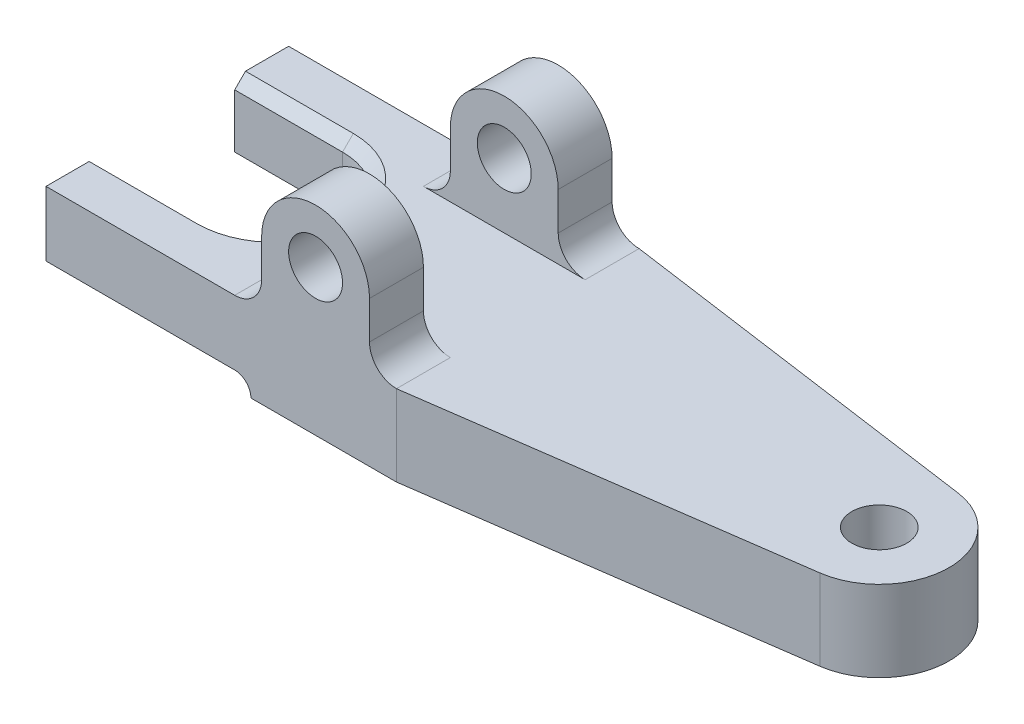
ISO-10303-21;
HEADER;
FILE_DESCRIPTION(('STEP AP214'),'2;1');
FILE_NAME('part.step','',(''),(''),'','','');
FILE_SCHEMA(('AUTOMOTIVE_DESIGN { 1 0 10303 214 1 1 1 1 }'));
ENDSEC;
DATA;
#1=APPLICATION_CONTEXT('core data for automotive mechanical design processes');
#2=APPLICATION_PROTOCOL_DEFINITION('international standard','automotive_design',2000,#1);
#3=PRODUCT_CONTEXT('',#1,'mechanical');
#4=PRODUCT('Part','Part','',(#3));
#5=PRODUCT_RELATED_PRODUCT_CATEGORY('part','',(#4));
#6=PRODUCT_DEFINITION_FORMATION('','',#4);
#7=PRODUCT_DEFINITION_CONTEXT('part definition',#1,'design');
#8=PRODUCT_DEFINITION('design','',#6,#7);
#9=PRODUCT_DEFINITION_SHAPE('','',#8);
#10=(LENGTH_UNIT() NAMED_UNIT(*) SI_UNIT(.MILLI.,.METRE.));
#11=(NAMED_UNIT(*) PLANE_ANGLE_UNIT() SI_UNIT($,.RADIAN.));
#12=(NAMED_UNIT(*) SI_UNIT($,.STERADIAN.) SOLID_ANGLE_UNIT());
#13=UNCERTAINTY_MEASURE_WITH_UNIT(LENGTH_MEASURE(1.E-05),#10,'distance_accuracy_value','');
#14=(GEOMETRIC_REPRESENTATION_CONTEXT(3) GLOBAL_UNCERTAINTY_ASSIGNED_CONTEXT((#13)) GLOBAL_UNIT_ASSIGNED_CONTEXT((#10,
#11,#12)) REPRESENTATION_CONTEXT('',''));
#15=CARTESIAN_POINT('',(0.,0.,0.));
#16=DIRECTION('',(0.,0.,1.));
#17=DIRECTION('',(1.,0.,0.));
#18=AXIS2_PLACEMENT_3D('',#15,#16,#17);
#19=CARTESIAN_POINT('',(112.050609730815,15.,0.));
#20=DIRECTION('',(0.,-1.,0.));
#21=DIRECTION('',(0.,0.,-1.));
#22=AXIS2_PLACEMENT_3D('',#19,#20,#21);
#23=PLANE('',#22);
#24=CARTESIAN_POINT('',(112.050609730815,15.,0.));
#25=DIRECTION('',(0.,1.,0.));
#26=DIRECTION('',(0.,0.,1.));
#27=AXIS2_PLACEMENT_3D('',#24,#25,#26);
#28=CIRCLE('',#27,5.09999999999999);
#29=CARTESIAN_POINT('',(112.050609730815,15.,5.09999999999999));
#30=VERTEX_POINT('',#29);
#31=EDGE_CURVE('E426',#30,#30,#28,.T.);
#32=ORIENTED_EDGE('',*,*,#31,.F.);
#33=EDGE_LOOP('',(#32));
#34=FACE_BOUND('',#33,.T.);
#35=CARTESIAN_POINT('',(0.,15.,0.));
#36=DIRECTION('',(0.,-1.,0.));
#37=DIRECTION('',(0.,0.,-1.));
#38=AXIS2_PLACEMENT_3D('',#35,#36,#37);
#39=CIRCLE('',#38,14.5);
#40=CARTESIAN_POINT('',(0.,15.,-14.5));
#41=VERTEX_POINT('',#40);
#42=CARTESIAN_POINT('',(0.,15.,14.5));
#43=VERTEX_POINT('',#42);
#44=EDGE_CURVE('E406',#41,#43,#39,.T.);
#45=ORIENTED_EDGE('',*,*,#44,.T.);
#46=DIRECTION('',(-1.,0.,0.));
#47=VECTOR('',#46,1.);
#48=CARTESIAN_POINT('',(112.050609730815,15.,14.5));
#49=LINE('',#48,#47);
#50=CARTESIAN_POINT('',(-20.,15.,14.5));
#51=VERTEX_POINT('',#50);
#52=EDGE_CURVE('E408',#43,#51,#49,.T.);
#53=ORIENTED_EDGE('',*,*,#52,.T.);
#54=DIRECTION('',(0.,0.,1.));
#55=VECTOR('',#54,1.);
#56=CARTESIAN_POINT('',(-20.,15.,22.5));
#57=LINE('',#56,#55);
#58=CARTESIAN_POINT('',(-20.,15.,22.5));
#59=VERTEX_POINT('',#58);
#60=EDGE_CURVE('E313',#51,#59,#57,.T.);
#61=ORIENTED_EDGE('',*,*,#60,.T.);
#62=DIRECTION('',(1.,0.,0.));
#63=VECTOR('',#62,1.);
#64=CARTESIAN_POINT('',(45.,15.,22.5));
#65=LINE('',#64,#63);
#66=CARTESIAN_POINT('',(15.,15.,22.5));
#67=VERTEX_POINT('',#66);
#68=EDGE_CURVE('E315',#59,#67,#65,.T.);
#69=ORIENTED_EDGE('',*,*,#68,.T.);
#70=DIRECTION('',(0.,0.,1.));
#71=VECTOR('',#70,1.);
#72=CARTESIAN_POINT('',(15.,15.,0.));
#73=LINE('',#72,#71);
#74=CARTESIAN_POINT('',(15.,15.,12.5));
#75=VERTEX_POINT('',#74);
#76=EDGE_CURVE('E366',#67,#75,#73,.F.);
#77=ORIENTED_EDGE('',*,*,#76,.T.);
#78=DIRECTION('',(1.,0.,0.));
#79=VECTOR('',#78,1.);
#80=CARTESIAN_POINT('',(40.,15.,12.5));
#81=LINE('',#80,#79);
#82=CARTESIAN_POINT('',(45.,15.,12.5));
#83=VERTEX_POINT('',#82);
#84=EDGE_CURVE('E262',#75,#83,#81,.T.);
#85=ORIENTED_EDGE('',*,*,#84,.T.);
#86=DIRECTION('',(0.,0.,1.));
#87=VECTOR('',#86,1.);
#88=CARTESIAN_POINT('',(45.,15.,0.));
#89=LINE('',#88,#87);
#90=CARTESIAN_POINT('',(45.,15.,22.5));
#91=VERTEX_POINT('',#90);
#92=EDGE_CURVE('E369',#83,#91,#89,.T.);
#93=ORIENTED_EDGE('',*,*,#92,.T.);
#94=DIRECTION('',(0.99026806874157,0.,-0.139173100960066));
#95=VECTOR('',#94,1.);
#96=CARTESIAN_POINT('',(113.85281653012,15.,12.8233676932463));
#97=LINE('',#96,#95);
#98=CARTESIAN_POINT('',(113.85281653012,15.,12.8233676932463));
#99=VERTEX_POINT('',#98);
#100=EDGE_CURVE('E319',#91,#99,#97,.T.);
#101=ORIENTED_EDGE('',*,*,#100,.T.);
#102=CARTESIAN_POINT('',(112.050609730815,15.,0.));
#103=DIRECTION('',(0.,1.,0.));
#104=DIRECTION('',(0.,0.,-1.));
#105=AXIS2_PLACEMENT_3D('',#102,#103,#104);
#106=CIRCLE('',#105,12.9493902691846);
#107=CARTESIAN_POINT('',(113.85281653012,15.,-12.8233676932463));
#108=VERTEX_POINT('',#107);
#109=EDGE_CURVE('E321',#99,#108,#106,.T.);
#110=ORIENTED_EDGE('',*,*,#109,.T.);
#111=DIRECTION('',(-0.99026806874157,0.,-0.139173100960066));
#112=VECTOR('',#111,1.);
#113=CARTESIAN_POINT('',(45.,15.,-22.5));
#114=LINE('',#113,#112);
#115=CARTESIAN_POINT('',(45.,15.,-22.5));
#116=VERTEX_POINT('',#115);
#117=EDGE_CURVE('E323',#108,#116,#114,.T.);
#118=ORIENTED_EDGE('',*,*,#117,.T.);
#119=DIRECTION('',(0.,0.,-1.));
#120=VECTOR('',#119,1.);
#121=CARTESIAN_POINT('',(45.,15.,-12.5));
#122=LINE('',#121,#120);
#123=CARTESIAN_POINT('',(45.,15.,-12.5));
#124=VERTEX_POINT('',#123);
#125=EDGE_CURVE('E392',#116,#124,#122,.F.);
#126=ORIENTED_EDGE('',*,*,#125,.T.);
#127=DIRECTION('',(1.,0.,0.));
#128=VECTOR('',#127,1.);
#129=CARTESIAN_POINT('',(40.,15.,-12.5));
#130=LINE('',#129,#128);
#131=CARTESIAN_POINT('',(15.,15.,-12.5));
#132=VERTEX_POINT('',#131);
#133=EDGE_CURVE('E242',#132,#124,#130,.T.);
#134=ORIENTED_EDGE('',*,*,#133,.F.);
#135=DIRECTION('',(0.,0.,-1.));
#136=VECTOR('',#135,1.);
#137=CARTESIAN_POINT('',(15.,15.,-22.5));
#138=LINE('',#137,#136);
#139=CARTESIAN_POINT('',(15.,15.,-22.5));
#140=VERTEX_POINT('',#139);
#141=EDGE_CURVE('E389',#132,#140,#138,.T.);
#142=ORIENTED_EDGE('',*,*,#141,.T.);
#143=DIRECTION('',(-1.,0.,0.));
#144=VECTOR('',#143,1.);
#145=CARTESIAN_POINT('',(-20.,15.,-22.5));
#146=LINE('',#145,#144);
#147=CARTESIAN_POINT('',(-20.,15.,-22.5));
#148=VERTEX_POINT('',#147);
#149=EDGE_CURVE('E326',#140,#148,#146,.T.);
#150=ORIENTED_EDGE('',*,*,#149,.T.);
#151=DIRECTION('',(0.,0.,1.));
#152=VECTOR('',#151,1.);
#153=CARTESIAN_POINT('',(-20.,15.,-12.5));
#154=LINE('',#153,#152);
#155=CARTESIAN_POINT('',(-20.,15.,-14.5));
#156=VERTEX_POINT('',#155);
#157=EDGE_CURVE('E328',#148,#156,#154,.T.);
#158=ORIENTED_EDGE('',*,*,#157,.T.);
#159=DIRECTION('',(1.,0.,0.));
#160=VECTOR('',#159,1.);
#161=CARTESIAN_POINT('',(112.050609730815,15.,-14.5000000000001));
#162=LINE('',#161,#160);
#163=EDGE_CURVE('E404',#156,#41,#162,.T.);
#164=ORIENTED_EDGE('',*,*,#163,.T.);
#165=EDGE_LOOP('',(#45,#53,#61,#69,#77,#85,#93,#101,#110,#118,#126,#134,#142,#150,#158,#164));
#166=FACE_BOUND('',#165,.T.);
#167=ADVANCED_FACE('F47',(#34,#166),#23,.F.);
#168=CARTESIAN_POINT('',(0.,15.,-12.5));
#169=DIRECTION('',(0.,0.,-1.));
#170=DIRECTION('',(-1.,0.,0.));
#171=AXIS2_PLACEMENT_3D('',#168,#169,#170);
#172=PLANE('',#171);
#173=DIRECTION('',(0.,-1.,0.));
#174=VECTOR('',#173,1.);
#175=CARTESIAN_POINT('',(0.,15.,-12.5));
#176=LINE('',#175,#174);
#177=CARTESIAN_POINT('',(0.,13.,-12.5));
#178=VERTEX_POINT('',#177);
#179=CARTESIAN_POINT('',(0.,3.,-12.5));
#180=VERTEX_POINT('',#179);
#181=EDGE_CURVE('E364',#178,#180,#176,.T.);
#182=ORIENTED_EDGE('',*,*,#181,.F.);
#183=DIRECTION('',(-1.,0.,0.));
#184=VECTOR('',#183,1.);
#185=CARTESIAN_POINT('',(0.,13.,-12.5));
#186=LINE('',#185,#184);
#187=CARTESIAN_POINT('',(-20.,13.,-12.5));
#188=VERTEX_POINT('',#187);
#189=EDGE_CURVE('E56',#178,#188,#186,.T.);
#190=ORIENTED_EDGE('',*,*,#189,.T.);
#191=DIRECTION('',(0.,-1.,0.));
#192=VECTOR('',#191,1.);
#193=CARTESIAN_POINT('',(-20.,15.,-12.5));
#194=LINE('',#193,#192);
#195=CARTESIAN_POINT('',(-20.,3.,-12.5));
#196=VERTEX_POINT('',#195);
#197=EDGE_CURVE('E331',#188,#196,#194,.T.);
#198=ORIENTED_EDGE('',*,*,#197,.T.);
#199=DIRECTION('',(1.,0.,0.));
#200=VECTOR('',#199,1.);
#201=CARTESIAN_POINT('',(0.,3.,-12.5));
#202=LINE('',#201,#200);
#203=EDGE_CURVE('E309',#196,#180,#202,.T.);
#204=ORIENTED_EDGE('',*,*,#203,.T.);
#205=EDGE_LOOP('',(#182,#190,#198,#204));
#206=FACE_BOUND('',#205,.T.);
#207=ADVANCED_FACE('F455',(#206),#172,.F.);
#208=CARTESIAN_POINT('',(0.,15.,0.));
#209=DIRECTION('',(0.,-1.,0.));
#210=DIRECTION('',(0.,0.,-1.));
#211=AXIS2_PLACEMENT_3D('',#208,#209,#210);
#212=CYLINDRICAL_SURFACE('',#211,12.5);
#213=DIRECTION('',(0.,-1.,0.));
#214=VECTOR('',#213,1.);
#215=CARTESIAN_POINT('',(0.,15.,12.5));
#216=LINE('',#215,#214);
#217=CARTESIAN_POINT('',(0.,13.,12.5));
#218=VERTEX_POINT('',#217);
#219=CARTESIAN_POINT('',(0.,3.,12.5));
#220=VERTEX_POINT('',#219);
#221=EDGE_CURVE('E362',#218,#220,#216,.T.);
#222=ORIENTED_EDGE('',*,*,#221,.F.);
#223=CARTESIAN_POINT('',(0.,13.,0.));
#224=DIRECTION('',(0.,-1.,0.));
#225=DIRECTION('',(0.,0.,-1.));
#226=AXIS2_PLACEMENT_3D('',#223,#224,#225);
#227=CIRCLE('',#226,12.5);
#228=EDGE_CURVE('E71',#218,#178,#227,.F.);
#229=ORIENTED_EDGE('',*,*,#228,.T.);
#230=ORIENTED_EDGE('',*,*,#181,.T.);
#231=CARTESIAN_POINT('',(0.,3.,0.));
#232=DIRECTION('',(0.,1.,0.));
#233=DIRECTION('',(-1.,0.,0.));
#234=AXIS2_PLACEMENT_3D('',#231,#232,#233);
#235=CIRCLE('',#234,12.5);
#236=EDGE_CURVE('E306',#180,#220,#235,.F.);
#237=ORIENTED_EDGE('',*,*,#236,.T.);
#238=EDGE_LOOP('',(#222,#229,#230,#237));
#239=FACE_BOUND('',#238,.T.);
#240=ADVANCED_FACE('F461',(#239),#212,.F.);
#241=CARTESIAN_POINT('',(-20.,15.,12.5));
#242=DIRECTION('',(0.,0.,1.));
#243=DIRECTION('',(1.,0.,0.));
#244=AXIS2_PLACEMENT_3D('',#241,#242,#243);
#245=PLANE('',#244);
#246=DIRECTION('',(0.,-1.,0.));
#247=VECTOR('',#246,1.);
#248=CARTESIAN_POINT('',(-20.,15.,12.5));
#249=LINE('',#248,#247);
#250=CARTESIAN_POINT('',(-20.,13.,12.5));
#251=VERTEX_POINT('',#250);
#252=CARTESIAN_POINT('',(-20.,3.,12.5));
#253=VERTEX_POINT('',#252);
#254=EDGE_CURVE('E360',#251,#253,#249,.T.);
#255=ORIENTED_EDGE('',*,*,#254,.F.);
#256=DIRECTION('',(1.,0.,0.));
#257=VECTOR('',#256,1.);
#258=CARTESIAN_POINT('',(-20.,13.,12.5));
#259=LINE('',#258,#257);
#260=EDGE_CURVE('E413',#251,#218,#259,.T.);
#261=ORIENTED_EDGE('',*,*,#260,.T.);
#262=ORIENTED_EDGE('',*,*,#221,.T.);
#263=DIRECTION('',(-1.,0.,0.));
#264=VECTOR('',#263,1.);
#265=CARTESIAN_POINT('',(-20.,3.,12.5));
#266=LINE('',#265,#264);
#267=EDGE_CURVE('E299',#220,#253,#266,.T.);
#268=ORIENTED_EDGE('',*,*,#267,.T.);
#269=EDGE_LOOP('',(#255,#261,#262,#268));
#270=FACE_BOUND('',#269,.T.);
#271=ADVANCED_FACE('F499',(#270),#245,.F.);
#272=CARTESIAN_POINT('',(-20.,15.,22.5));
#273=DIRECTION('',(1.,0.,0.));
#274=DIRECTION('',(0.,0.,-1.));
#275=AXIS2_PLACEMENT_3D('',#272,#273,#274);
#276=PLANE('',#275);
#277=ORIENTED_EDGE('',*,*,#60,.F.);
#278=DIRECTION('',(0.,0.70710678118655,0.707106781186545));
#279=VECTOR('',#278,1.);
#280=CARTESIAN_POINT('',(-20.,15.,14.5));
#281=LINE('',#280,#279);
#282=EDGE_CURVE('E411',#51,#251,#281,.F.);
#283=ORIENTED_EDGE('',*,*,#282,.T.);
#284=ORIENTED_EDGE('',*,*,#254,.T.);
#285=DIRECTION('',(0.,0.,1.));
#286=VECTOR('',#285,1.);
#287=CARTESIAN_POINT('',(-20.,3.,-22.5));
#288=LINE('',#287,#286);
#289=CARTESIAN_POINT('',(-20.,3.,22.5));
#290=VERTEX_POINT('',#289);
#291=EDGE_CURVE('E300',#253,#290,#288,.T.);
#292=ORIENTED_EDGE('',*,*,#291,.T.);
#293=DIRECTION('',(0.,-1.,0.));
#294=VECTOR('',#293,1.);
#295=CARTESIAN_POINT('',(-20.,15.,22.5));
#296=LINE('',#295,#294);
#297=EDGE_CURVE('E357',#59,#290,#296,.T.);
#298=ORIENTED_EDGE('',*,*,#297,.F.);
#299=EDGE_LOOP('',(#277,#283,#284,#292,#298));
#300=FACE_BOUND('',#299,.T.);
#301=ADVANCED_FACE('F495',(#300),#276,.F.);
#302=CARTESIAN_POINT('',(45.,15.,22.5));
#303=DIRECTION('',(0.,0.,-1.));
#304=DIRECTION('',(-1.,0.,0.));
#305=AXIS2_PLACEMENT_3D('',#302,#303,#304);
#306=PLANE('',#305);
#307=ORIENTED_EDGE('',*,*,#297,.T.);
#308=DIRECTION('',(-1.,0.,0.));
#309=VECTOR('',#308,1.);
#310=CARTESIAN_POINT('',(-20.,3.,22.5));
#311=LINE('',#310,#309);
#312=CARTESIAN_POINT('',(15.,3.,22.5));
#313=VERTEX_POINT('',#312);
#314=EDGE_CURVE('E289',#313,#290,#311,.T.);
#315=ORIENTED_EDGE('',*,*,#314,.F.);
#316=CARTESIAN_POINT('',(15.,0.,22.5));
#317=DIRECTION('',(0.,0.,1.));
#318=DIRECTION('',(-1.,0.,0.));
#319=AXIS2_PLACEMENT_3D('',#316,#317,#318);
#320=CIRCLE('',#319,3.);
#321=CARTESIAN_POINT('',(18.,0.,22.5));
#322=VERTEX_POINT('',#321);
#323=EDGE_CURVE('E282',#322,#313,#320,.T.);
#324=ORIENTED_EDGE('',*,*,#323,.F.);
#325=DIRECTION('',(1.,0.,0.));
#326=VECTOR('',#325,1.);
#327=CARTESIAN_POINT('',(45.,0.,22.5));
#328=LINE('',#327,#326);
#329=CARTESIAN_POINT('',(45.,0.,22.5));
#330=VERTEX_POINT('',#329);
#331=EDGE_CURVE('E312',#322,#330,#328,.T.);
#332=ORIENTED_EDGE('',*,*,#331,.T.);
#333=DIRECTION('',(0.,-1.,0.));
#334=VECTOR('',#333,1.);
#335=CARTESIAN_POINT('',(45.,15.,22.5));
#336=LINE('',#335,#334);
#337=EDGE_CURVE('E354',#91,#330,#336,.T.);
#338=ORIENTED_EDGE('',*,*,#337,.F.);
#339=CARTESIAN_POINT('',(45.,20.,22.5));
#340=DIRECTION('',(0.,0.,-1.));
#341=DIRECTION('',(-1.,0.,0.));
#342=AXIS2_PLACEMENT_3D('',#339,#340,#341);
#343=CIRCLE('',#342,5.);
#344=CARTESIAN_POINT('',(40.,20.,22.5));
#345=VERTEX_POINT('',#344);
#346=EDGE_CURVE('E377',#91,#345,#343,.T.);
#347=ORIENTED_EDGE('',*,*,#346,.T.);
#348=DIRECTION('',(0.,1.,0.));
#349=VECTOR('',#348,1.);
#350=CARTESIAN_POINT('',(40.,27.,22.5));
#351=LINE('',#350,#349);
#352=CARTESIAN_POINT('',(40.,27.,22.5));
#353=VERTEX_POINT('',#352);
#354=EDGE_CURVE('E259',#345,#353,#351,.T.);
#355=ORIENTED_EDGE('',*,*,#354,.T.);
#356=CARTESIAN_POINT('',(30.,27.,22.5));
#357=DIRECTION('',(0.,0.,1.));
#358=DIRECTION('',(-1.,0.,0.));
#359=AXIS2_PLACEMENT_3D('',#356,#357,#358);
#360=CIRCLE('',#359,10.);
#361=CARTESIAN_POINT('',(20.,27.,22.5));
#362=VERTEX_POINT('',#361);
#363=EDGE_CURVE('E275',#353,#362,#360,.T.);
#364=ORIENTED_EDGE('',*,*,#363,.T.);
#365=DIRECTION('',(0.,-1.,0.));
#366=VECTOR('',#365,1.);
#367=CARTESIAN_POINT('',(20.,15.,22.5));
#368=LINE('',#367,#366);
#369=CARTESIAN_POINT('',(20.,20.,22.5));
#370=VERTEX_POINT('',#369);
#371=EDGE_CURVE('E265',#362,#370,#368,.T.);
#372=ORIENTED_EDGE('',*,*,#371,.T.);
#373=CARTESIAN_POINT('',(15.,20.,22.5));
#374=DIRECTION('',(0.,0.,-1.));
#375=DIRECTION('',(-1.,0.,0.));
#376=AXIS2_PLACEMENT_3D('',#373,#374,#375);
#377=CIRCLE('',#376,5.);
#378=EDGE_CURVE('E382',#370,#67,#377,.T.);
#379=ORIENTED_EDGE('',*,*,#378,.T.);
#380=ORIENTED_EDGE('',*,*,#68,.F.);
#381=EDGE_LOOP('',(#307,#315,#324,#332,#338,#347,#355,#364,#372,#379,#380));
#382=FACE_BOUND('',#381,.T.);
#383=CARTESIAN_POINT('',(30.,27.,22.5));
#384=DIRECTION('',(0.,0.,1.));
#385=DIRECTION('',(1.,0.,0.));
#386=AXIS2_PLACEMENT_3D('',#383,#384,#385);
#387=CIRCLE('',#386,4.99999999999999);
#388=CARTESIAN_POINT('',(35.,27.,22.5));
#389=VERTEX_POINT('',#388);
#390=EDGE_CURVE('E254',#389,#389,#387,.T.);
#391=ORIENTED_EDGE('',*,*,#390,.F.);
#392=EDGE_LOOP('',(#391));
#393=FACE_BOUND('',#392,.T.);
#394=ADVANCED_FACE('F491',(#382,#393),#306,.F.);
#395=CARTESIAN_POINT('',(113.85281653012,15.,12.8233676932463));
#396=DIRECTION('',(-0.139173100960066,0.,-0.99026806874157));
#397=DIRECTION('',(-0.99026806874157,0.,0.139173100960066));
#398=AXIS2_PLACEMENT_3D('',#395,#396,#397);
#399=PLANE('',#398);
#400=DIRECTION('',(0.99026806874157,0.,-0.139173100960066));
#401=VECTOR('',#400,1.);
#402=CARTESIAN_POINT('',(113.85281653012,0.,12.8233676932463));
#403=LINE('',#402,#401);
#404=CARTESIAN_POINT('',(113.85281653012,0.,12.8233676932463));
#405=VERTEX_POINT('',#404);
#406=EDGE_CURVE('E333',#330,#405,#403,.T.);
#407=ORIENTED_EDGE('',*,*,#406,.T.);
#408=DIRECTION('',(0.,-1.,0.));
#409=VECTOR('',#408,1.);
#410=CARTESIAN_POINT('',(113.85281653012,15.,12.8233676932463));
#411=LINE('',#410,#409);
#412=EDGE_CURVE('E351',#99,#405,#411,.T.);
#413=ORIENTED_EDGE('',*,*,#412,.F.);
#414=ORIENTED_EDGE('',*,*,#100,.F.);
#415=ORIENTED_EDGE('',*,*,#337,.T.);
#416=EDGE_LOOP('',(#407,#413,#414,#415));
#417=FACE_BOUND('',#416,.T.);
#418=ADVANCED_FACE('F487',(#417),#399,.F.);
#419=CARTESIAN_POINT('',(112.050609730815,15.,0.));
#420=DIRECTION('',(0.,-1.,0.));
#421=DIRECTION('',(0.,0.,-1.));
#422=AXIS2_PLACEMENT_3D('',#419,#420,#421);
#423=CYLINDRICAL_SURFACE('',#422,12.9493902691846);
#424=CARTESIAN_POINT('',(112.050609730815,0.,0.));
#425=DIRECTION('',(0.,1.,0.));
#426=DIRECTION('',(0.,0.,-1.));
#427=AXIS2_PLACEMENT_3D('',#424,#425,#426);
#428=CIRCLE('',#427,12.9493902691846);
#429=CARTESIAN_POINT('',(113.85281653012,0.,-12.8233676932463));
#430=VERTEX_POINT('',#429);
#431=EDGE_CURVE('E335',#405,#430,#428,.T.);
#432=ORIENTED_EDGE('',*,*,#431,.T.);
#433=DIRECTION('',(0.,-1.,0.));
#434=VECTOR('',#433,1.);
#435=CARTESIAN_POINT('',(113.85281653012,15.,-12.8233676932463));
#436=LINE('',#435,#434);
#437=EDGE_CURVE('E348',#108,#430,#436,.T.);
#438=ORIENTED_EDGE('',*,*,#437,.F.);
#439=ORIENTED_EDGE('',*,*,#109,.F.);
#440=ORIENTED_EDGE('',*,*,#412,.T.);
#441=EDGE_LOOP('',(#432,#438,#439,#440));
#442=FACE_BOUND('',#441,.T.);
#443=ADVANCED_FACE('F483',(#442),#423,.T.);
#444=CARTESIAN_POINT('',(45.,15.,-22.5));
#445=DIRECTION('',(-0.139173100960066,0.,0.99026806874157));
#446=DIRECTION('',(0.99026806874157,0.,0.139173100960066));
#447=AXIS2_PLACEMENT_3D('',#444,#445,#446);
#448=PLANE('',#447);
#449=DIRECTION('',(-0.99026806874157,0.,-0.139173100960066));
#450=VECTOR('',#449,1.);
#451=CARTESIAN_POINT('',(45.,0.,-22.5));
#452=LINE('',#451,#450);
#453=CARTESIAN_POINT('',(45.,0.,-22.5));
#454=VERTEX_POINT('',#453);
#455=EDGE_CURVE('E337',#430,#454,#452,.T.);
#456=ORIENTED_EDGE('',*,*,#455,.T.);
#457=DIRECTION('',(0.,-1.,0.));
#458=VECTOR('',#457,1.);
#459=CARTESIAN_POINT('',(45.,15.,-22.5));
#460=LINE('',#459,#458);
#461=EDGE_CURVE('E345',#116,#454,#460,.T.);
#462=ORIENTED_EDGE('',*,*,#461,.F.);
#463=ORIENTED_EDGE('',*,*,#117,.F.);
#464=ORIENTED_EDGE('',*,*,#437,.T.);
#465=EDGE_LOOP('',(#456,#462,#463,#464));
#466=FACE_BOUND('',#465,.T.);
#467=ADVANCED_FACE('F479',(#466),#448,.F.);
#468=CARTESIAN_POINT('',(-20.,15.,-22.5));
#469=DIRECTION('',(0.,0.,1.));
#470=DIRECTION('',(1.,0.,0.));
#471=AXIS2_PLACEMENT_3D('',#468,#469,#470);
#472=PLANE('',#471);
#473=CARTESIAN_POINT('',(15.,0.,-22.5));
#474=DIRECTION('',(0.,0.,1.));
#475=DIRECTION('',(-1.,0.,0.));
#476=AXIS2_PLACEMENT_3D('',#473,#474,#475);
#477=CIRCLE('',#476,3.);
#478=CARTESIAN_POINT('',(18.,0.,-22.5));
#479=VERTEX_POINT('',#478);
#480=CARTESIAN_POINT('',(15.,3.,-22.5));
#481=VERTEX_POINT('',#480);
#482=EDGE_CURVE('E285',#479,#481,#477,.T.);
#483=ORIENTED_EDGE('',*,*,#482,.T.);
#484=DIRECTION('',(-1.,0.,0.));
#485=VECTOR('',#484,1.);
#486=CARTESIAN_POINT('',(-20.,3.,-22.5));
#487=LINE('',#486,#485);
#488=CARTESIAN_POINT('',(-20.,3.,-22.5));
#489=VERTEX_POINT('',#488);
#490=EDGE_CURVE('E288',#481,#489,#487,.T.);
#491=ORIENTED_EDGE('',*,*,#490,.T.);
#492=DIRECTION('',(0.,-1.,0.));
#493=VECTOR('',#492,1.);
#494=CARTESIAN_POINT('',(-20.,15.,-22.5));
#495=LINE('',#494,#493);
#496=EDGE_CURVE('E342',#148,#489,#495,.T.);
#497=ORIENTED_EDGE('',*,*,#496,.F.);
#498=ORIENTED_EDGE('',*,*,#149,.F.);
#499=CARTESIAN_POINT('',(15.,20.,-22.5));
#500=DIRECTION('',(0.,0.,1.));
#501=DIRECTION('',(1.,0.,0.));
#502=AXIS2_PLACEMENT_3D('',#499,#500,#501);
#503=CIRCLE('',#502,5.);
#504=CARTESIAN_POINT('',(20.,20.,-22.5));
#505=VERTEX_POINT('',#504);
#506=EDGE_CURVE('E400',#140,#505,#503,.T.);
#507=ORIENTED_EDGE('',*,*,#506,.T.);
#508=DIRECTION('',(0.,-1.,0.));
#509=VECTOR('',#508,1.);
#510=CARTESIAN_POINT('',(20.,15.,-22.5));
#511=LINE('',#510,#509);
#512=CARTESIAN_POINT('',(20.,27.,-22.5));
#513=VERTEX_POINT('',#512);
#514=EDGE_CURVE('E249',#513,#505,#511,.T.);
#515=ORIENTED_EDGE('',*,*,#514,.F.);
#516=CARTESIAN_POINT('',(30.,27.,-22.5));
#517=DIRECTION('',(0.,0.,1.));
#518=DIRECTION('',(-1.,0.,0.));
#519=AXIS2_PLACEMENT_3D('',#516,#517,#518);
#520=CIRCLE('',#519,10.);
#521=CARTESIAN_POINT('',(40.,27.,-22.5));
#522=VERTEX_POINT('',#521);
#523=EDGE_CURVE('E233',#522,#513,#520,.T.);
#524=ORIENTED_EDGE('',*,*,#523,.F.);
#525=DIRECTION('',(0.,1.,0.));
#526=VECTOR('',#525,1.);
#527=CARTESIAN_POINT('',(40.,27.,-22.5));
#528=LINE('',#527,#526);
#529=CARTESIAN_POINT('',(40.,20.,-22.5));
#530=VERTEX_POINT('',#529);
#531=EDGE_CURVE('E244',#530,#522,#528,.T.);
#532=ORIENTED_EDGE('',*,*,#531,.F.);
#533=CARTESIAN_POINT('',(45.,20.,-22.5));
#534=DIRECTION('',(0.,0.,1.));
#535=DIRECTION('',(1.,0.,0.));
#536=AXIS2_PLACEMENT_3D('',#533,#534,#535);
#537=CIRCLE('',#536,5.);
#538=EDGE_CURVE('E396',#530,#116,#537,.T.);
#539=ORIENTED_EDGE('',*,*,#538,.T.);
#540=ORIENTED_EDGE('',*,*,#461,.T.);
#541=DIRECTION('',(-1.,0.,0.));
#542=VECTOR('',#541,1.);
#543=CARTESIAN_POINT('',(-20.,0.,-22.5));
#544=LINE('',#543,#542);
#545=EDGE_CURVE('E316',#454,#479,#544,.T.);
#546=ORIENTED_EDGE('',*,*,#545,.T.);
#547=EDGE_LOOP('',(#483,#491,#497,#498,#507,#515,#524,#532,#539,#540,#546));
#548=FACE_BOUND('',#547,.T.);
#549=CARTESIAN_POINT('',(30.,27.,-22.5));
#550=DIRECTION('',(0.,0.,1.));
#551=DIRECTION('',(1.,0.,0.));
#552=AXIS2_PLACEMENT_3D('',#549,#550,#551);
#553=CIRCLE('',#552,4.99999999999999);
#554=CARTESIAN_POINT('',(35.,27.,-22.5));
#555=VERTEX_POINT('',#554);
#556=EDGE_CURVE('E424',#555,#555,#553,.T.);
#557=ORIENTED_EDGE('',*,*,#556,.T.);
#558=EDGE_LOOP('',(#557));
#559=FACE_BOUND('',#558,.T.);
#560=ADVANCED_FACE('F437',(#548,#559),#472,.F.);
#561=CARTESIAN_POINT('',(-20.,15.,-12.5));
#562=DIRECTION('',(1.,0.,0.));
#563=DIRECTION('',(0.,0.,-1.));
#564=AXIS2_PLACEMENT_3D('',#561,#562,#563);
#565=PLANE('',#564);
#566=ORIENTED_EDGE('',*,*,#197,.F.);
#567=DIRECTION('',(0.,-0.70710678118655,0.707106781186545));
#568=VECTOR('',#567,1.);
#569=CARTESIAN_POINT('',(-20.,15.,-14.5));
#570=LINE('',#569,#568);
#571=EDGE_CURVE('E13',#188,#156,#570,.F.);
#572=ORIENTED_EDGE('',*,*,#571,.T.);
#573=ORIENTED_EDGE('',*,*,#157,.F.);
#574=ORIENTED_EDGE('',*,*,#496,.T.);
#575=EDGE_CURVE('E296',#489,#196,#288,.T.);
#576=ORIENTED_EDGE('',*,*,#575,.T.);
#577=EDGE_LOOP('',(#566,#572,#573,#574,#576));
#578=FACE_BOUND('',#577,.T.);
#579=ADVANCED_FACE('F473',(#578),#565,.F.);
#580=CARTESIAN_POINT('',(112.050609730815,0.,0.));
#581=DIRECTION('',(0.,-1.,0.));
#582=DIRECTION('',(0.,0.,-1.));
#583=AXIS2_PLACEMENT_3D('',#580,#581,#582);
#584=PLANE('',#583);
#585=CARTESIAN_POINT('',(112.050609730815,0.,0.));
#586=DIRECTION('',(0.,1.,0.));
#587=DIRECTION('',(0.,0.,1.));
#588=AXIS2_PLACEMENT_3D('',#585,#586,#587);
#589=CIRCLE('',#588,5.09999999999999);
#590=CARTESIAN_POINT('',(112.050609730815,0.,5.09999999999999));
#591=VERTEX_POINT('',#590);
#592=EDGE_CURVE('E418',#591,#591,#589,.T.);
#593=ORIENTED_EDGE('',*,*,#592,.T.);
#594=EDGE_LOOP('',(#593));
#595=FACE_BOUND('',#594,.T.);
#596=DIRECTION('',(0.,0.,1.));
#597=VECTOR('',#596,1.);
#598=CARTESIAN_POINT('',(18.,0.,-22.5));
#599=LINE('',#598,#597);
#600=EDGE_CURVE('E292',#479,#322,#599,.T.);
#601=ORIENTED_EDGE('',*,*,#600,.F.);
#602=ORIENTED_EDGE('',*,*,#545,.F.);
#603=ORIENTED_EDGE('',*,*,#455,.F.);
#604=ORIENTED_EDGE('',*,*,#431,.F.);
#605=ORIENTED_EDGE('',*,*,#406,.F.);
#606=ORIENTED_EDGE('',*,*,#331,.F.);
#607=EDGE_LOOP('',(#601,#602,#603,#604,#605,#606));
#608=FACE_BOUND('',#607,.T.);
#609=ADVANCED_FACE('F469',(#595,#608),#584,.T.);
#610=CARTESIAN_POINT('',(-20.,3.,-22.5));
#611=DIRECTION('',(0.,1.,0.));
#612=DIRECTION('',(-1.,0.,0.));
#613=AXIS2_PLACEMENT_3D('',#610,#611,#612);
#614=PLANE('',#613);
#615=ORIENTED_EDGE('',*,*,#575,.F.);
#616=ORIENTED_EDGE('',*,*,#490,.F.);
#617=DIRECTION('',(0.,0.,1.));
#618=VECTOR('',#617,1.);
#619=CARTESIAN_POINT('',(15.,3.,-22.5));
#620=LINE('',#619,#618);
#621=EDGE_CURVE('E301',#481,#313,#620,.T.);
#622=ORIENTED_EDGE('',*,*,#621,.T.);
#623=ORIENTED_EDGE('',*,*,#314,.T.);
#624=ORIENTED_EDGE('',*,*,#291,.F.);
#625=ORIENTED_EDGE('',*,*,#267,.F.);
#626=ORIENTED_EDGE('',*,*,#236,.F.);
#627=ORIENTED_EDGE('',*,*,#203,.F.);
#628=EDGE_LOOP('',(#615,#616,#622,#623,#624,#625,#626,#627));
#629=FACE_BOUND('',#628,.T.);
#630=ADVANCED_FACE('F472',(#629),#614,.F.);
#631=CARTESIAN_POINT('',(15.,0.,-22.5));
#632=DIRECTION('',(0.,0.,1.));
#633=DIRECTION('',(1.,0.,0.));
#634=AXIS2_PLACEMENT_3D('',#631,#632,#633);
#635=CYLINDRICAL_SURFACE('',#634,3.);
#636=ORIENTED_EDGE('',*,*,#323,.T.);
#637=ORIENTED_EDGE('',*,*,#621,.F.);
#638=ORIENTED_EDGE('',*,*,#482,.F.);
#639=ORIENTED_EDGE('',*,*,#600,.T.);
#640=EDGE_LOOP('',(#636,#637,#638,#639));
#641=FACE_BOUND('',#640,.T.);
#642=ADVANCED_FACE('F467',(#641),#635,.F.);
#643=CARTESIAN_POINT('',(20.,15.,12.5));
#644=DIRECTION('',(-1.,0.,0.));
#645=DIRECTION('',(0.,0.,1.));
#646=AXIS2_PLACEMENT_3D('',#643,#644,#645);
#647=PLANE('',#646);
#648=DIRECTION('',(0.,-1.,0.));
#649=VECTOR('',#648,1.);
#650=CARTESIAN_POINT('',(20.,15.,12.5));
#651=LINE('',#650,#649);
#652=CARTESIAN_POINT('',(20.,27.,12.5));
#653=VERTEX_POINT('',#652);
#654=CARTESIAN_POINT('',(20.,20.,12.5));
#655=VERTEX_POINT('',#654);
#656=EDGE_CURVE('E270',#653,#655,#651,.T.);
#657=ORIENTED_EDGE('',*,*,#656,.T.);
#658=DIRECTION('',(0.,0.,1.));
#659=VECTOR('',#658,1.);
#660=CARTESIAN_POINT('',(20.,20.,12.5));
#661=LINE('',#660,#659);
#662=EDGE_CURVE('E374',#655,#370,#661,.T.);
#663=ORIENTED_EDGE('',*,*,#662,.T.);
#664=ORIENTED_EDGE('',*,*,#371,.F.);
#665=DIRECTION('',(0.,0.,1.));
#666=VECTOR('',#665,1.);
#667=CARTESIAN_POINT('',(20.,27.,12.5));
#668=LINE('',#667,#666);
#669=EDGE_CURVE('E280',#653,#362,#668,.T.);
#670=ORIENTED_EDGE('',*,*,#669,.F.);
#671=EDGE_LOOP('',(#657,#663,#664,#670));
#672=FACE_BOUND('',#671,.T.);
#673=ADVANCED_FACE('F558',(#672),#647,.T.);
#674=CARTESIAN_POINT('',(30.,27.,12.5));
#675=DIRECTION('',(0.,0.,1.));
#676=DIRECTION('',(1.,0.,0.));
#677=AXIS2_PLACEMENT_3D('',#674,#675,#676);
#678=CYLINDRICAL_SURFACE('',#677,10.);
#679=ORIENTED_EDGE('',*,*,#363,.F.);
#680=DIRECTION('',(0.,0.,1.));
#681=VECTOR('',#680,1.);
#682=CARTESIAN_POINT('',(40.,27.,12.5));
#683=LINE('',#682,#681);
#684=CARTESIAN_POINT('',(40.,27.,12.5));
#685=VERTEX_POINT('',#684);
#686=EDGE_CURVE('E273',#685,#353,#683,.T.);
#687=ORIENTED_EDGE('',*,*,#686,.F.);
#688=CARTESIAN_POINT('',(30.,27.,12.5));
#689=DIRECTION('',(0.,0.,1.));
#690=DIRECTION('',(-1.,0.,0.));
#691=AXIS2_PLACEMENT_3D('',#688,#689,#690);
#692=CIRCLE('',#691,10.);
#693=EDGE_CURVE('E267',#685,#653,#692,.T.);
#694=ORIENTED_EDGE('',*,*,#693,.T.);
#695=ORIENTED_EDGE('',*,*,#669,.T.);
#696=EDGE_LOOP('',(#679,#687,#694,#695));
#697=FACE_BOUND('',#696,.T.);
#698=ADVANCED_FACE('F563',(#697),#678,.T.);
#699=CARTESIAN_POINT('',(40.,27.,12.5));
#700=DIRECTION('',(1.,0.,0.));
#701=DIRECTION('',(0.,1.,0.));
#702=AXIS2_PLACEMENT_3D('',#699,#700,#701);
#703=PLANE('',#702);
#704=ORIENTED_EDGE('',*,*,#354,.F.);
#705=DIRECTION('',(0.,0.,1.));
#706=VECTOR('',#705,1.);
#707=CARTESIAN_POINT('',(40.,20.,12.5));
#708=LINE('',#707,#706);
#709=CARTESIAN_POINT('',(40.,20.,12.5));
#710=VERTEX_POINT('',#709);
#711=EDGE_CURVE('E372',#345,#710,#708,.F.);
#712=ORIENTED_EDGE('',*,*,#711,.T.);
#713=DIRECTION('',(0.,1.,0.));
#714=VECTOR('',#713,1.);
#715=CARTESIAN_POINT('',(40.,27.,12.5));
#716=LINE('',#715,#714);
#717=EDGE_CURVE('E264',#710,#685,#716,.T.);
#718=ORIENTED_EDGE('',*,*,#717,.T.);
#719=ORIENTED_EDGE('',*,*,#686,.T.);
#720=EDGE_LOOP('',(#704,#712,#718,#719));
#721=FACE_BOUND('',#720,.T.);
#722=ADVANCED_FACE('F601',(#721),#703,.T.);
#723=CARTESIAN_POINT('',(30.,27.,12.5));
#724=DIRECTION('',(0.,0.,-1.));
#725=DIRECTION('',(-1.,0.,0.));
#726=AXIS2_PLACEMENT_3D('',#723,#724,#725);
#727=PLANE('',#726);
#728=CARTESIAN_POINT('',(30.,27.,12.5));
#729=DIRECTION('',(0.,0.,1.));
#730=DIRECTION('',(1.,0.,0.));
#731=AXIS2_PLACEMENT_3D('',#728,#729,#730);
#732=CIRCLE('',#731,4.99999999999999);
#733=CARTESIAN_POINT('',(35.,27.,12.5));
#734=VERTEX_POINT('',#733);
#735=EDGE_CURVE('E256',#734,#734,#732,.T.);
#736=ORIENTED_EDGE('',*,*,#735,.T.);
#737=EDGE_LOOP('',(#736));
#738=FACE_BOUND('',#737,.T.);
#739=ORIENTED_EDGE('',*,*,#84,.F.);
#740=CARTESIAN_POINT('',(15.,20.,12.5));
#741=DIRECTION('',(0.,0.,-1.));
#742=DIRECTION('',(-1.,0.,0.));
#743=AXIS2_PLACEMENT_3D('',#740,#741,#742);
#744=CIRCLE('',#743,5.);
#745=EDGE_CURVE('E384',#75,#655,#744,.F.);
#746=ORIENTED_EDGE('',*,*,#745,.T.);
#747=ORIENTED_EDGE('',*,*,#656,.F.);
#748=ORIENTED_EDGE('',*,*,#693,.F.);
#749=ORIENTED_EDGE('',*,*,#717,.F.);
#750=CARTESIAN_POINT('',(45.,20.,12.5));
#751=DIRECTION('',(0.,0.,-1.));
#752=DIRECTION('',(-1.,0.,0.));
#753=AXIS2_PLACEMENT_3D('',#750,#751,#752);
#754=CIRCLE('',#753,5.);
#755=EDGE_CURVE('E379',#710,#83,#754,.F.);
#756=ORIENTED_EDGE('',*,*,#755,.T.);
#757=EDGE_LOOP('',(#739,#746,#747,#748,#749,#756));
#758=FACE_BOUND('',#757,.T.);
#759=ADVANCED_FACE('F555',(#738,#758),#727,.T.);
#760=CARTESIAN_POINT('',(30.,27.,12.5));
#761=DIRECTION('',(0.,0.,1.));
#762=DIRECTION('',(1.,0.,0.));
#763=AXIS2_PLACEMENT_3D('',#760,#761,#762);
#764=CYLINDRICAL_SURFACE('',#763,4.99999999999999);
#765=ORIENTED_EDGE('',*,*,#735,.F.);
#766=EDGE_LOOP('',(#765));
#767=FACE_BOUND('',#766,.T.);
#768=ORIENTED_EDGE('',*,*,#390,.T.);
#769=EDGE_LOOP('',(#768));
#770=FACE_BOUND('',#769,.T.);
#771=ADVANCED_FACE('F510',(#767,#770),#764,.F.);
#772=CARTESIAN_POINT('',(45.,20.,0.));
#773=DIRECTION('',(0.,0.,1.));
#774=DIRECTION('',(1.,0.,0.));
#775=AXIS2_PLACEMENT_3D('',#772,#773,#774);
#776=CYLINDRICAL_SURFACE('',#775,5.);
#777=ORIENTED_EDGE('',*,*,#755,.F.);
#778=ORIENTED_EDGE('',*,*,#711,.F.);
#779=ORIENTED_EDGE('',*,*,#346,.F.);
#780=ORIENTED_EDGE('',*,*,#92,.F.);
#781=EDGE_LOOP('',(#777,#778,#779,#780));
#782=FACE_BOUND('',#781,.T.);
#783=ADVANCED_FACE('F506',(#782),#776,.F.);
#784=CARTESIAN_POINT('',(15.,20.,12.5));
#785=DIRECTION('',(0.,0.,1.));
#786=DIRECTION('',(1.,0.,0.));
#787=AXIS2_PLACEMENT_3D('',#784,#785,#786);
#788=CYLINDRICAL_SURFACE('',#787,5.);
#789=ORIENTED_EDGE('',*,*,#745,.F.);
#790=ORIENTED_EDGE('',*,*,#76,.F.);
#791=ORIENTED_EDGE('',*,*,#378,.F.);
#792=ORIENTED_EDGE('',*,*,#662,.F.);
#793=EDGE_LOOP('',(#789,#790,#791,#792));
#794=FACE_BOUND('',#793,.T.);
#795=ADVANCED_FACE('F509',(#794),#788,.F.);
#796=CARTESIAN_POINT('',(30.,27.,-12.5));
#797=DIRECTION('',(0.,0.,1.));
#798=DIRECTION('',(-1.,0.,0.));
#799=AXIS2_PLACEMENT_3D('',#796,#797,#798);
#800=PLANE('',#799);
#801=ORIENTED_EDGE('',*,*,#133,.T.);
#802=CARTESIAN_POINT('',(45.,20.,-12.5));
#803=DIRECTION('',(0.,0.,1.));
#804=DIRECTION('',(1.,0.,0.));
#805=AXIS2_PLACEMENT_3D('',#802,#803,#804);
#806=CIRCLE('',#805,5.);
#807=CARTESIAN_POINT('',(40.,20.,-12.5));
#808=VERTEX_POINT('',#807);
#809=EDGE_CURVE('E398',#124,#808,#806,.F.);
#810=ORIENTED_EDGE('',*,*,#809,.T.);
#811=DIRECTION('',(0.,1.,0.));
#812=VECTOR('',#811,1.);
#813=CARTESIAN_POINT('',(40.,27.,-12.5));
#814=LINE('',#813,#812);
#815=CARTESIAN_POINT('',(40.,27.,-12.5));
#816=VERTEX_POINT('',#815);
#817=EDGE_CURVE('E224',#808,#816,#814,.T.);
#818=ORIENTED_EDGE('',*,*,#817,.T.);
#819=CARTESIAN_POINT('',(30.,27.,-12.5));
#820=DIRECTION('',(0.,0.,1.));
#821=DIRECTION('',(-1.,0.,0.));
#822=AXIS2_PLACEMENT_3D('',#819,#820,#821);
#823=CIRCLE('',#822,10.);
#824=CARTESIAN_POINT('',(20.,27.,-12.5));
#825=VERTEX_POINT('',#824);
#826=EDGE_CURVE('E215',#816,#825,#823,.T.);
#827=ORIENTED_EDGE('',*,*,#826,.T.);
#828=DIRECTION('',(0.,-1.,0.));
#829=VECTOR('',#828,1.);
#830=CARTESIAN_POINT('',(20.,15.,-12.5));
#831=LINE('',#830,#829);
#832=CARTESIAN_POINT('',(20.,20.,-12.5));
#833=VERTEX_POINT('',#832);
#834=EDGE_CURVE('E221',#825,#833,#831,.T.);
#835=ORIENTED_EDGE('',*,*,#834,.T.);
#836=CARTESIAN_POINT('',(15.,20.,-12.5));
#837=DIRECTION('',(0.,0.,1.));
#838=DIRECTION('',(1.,0.,0.));
#839=AXIS2_PLACEMENT_3D('',#836,#837,#838);
#840=CIRCLE('',#839,5.);
#841=EDGE_CURVE('E402',#833,#132,#840,.F.);
#842=ORIENTED_EDGE('',*,*,#841,.T.);
#843=EDGE_LOOP('',(#801,#810,#818,#827,#835,#842));
#844=FACE_BOUND('',#843,.T.);
#845=CARTESIAN_POINT('',(30.,27.,-12.5));
#846=DIRECTION('',(0.,0.,1.));
#847=DIRECTION('',(1.,0.,0.));
#848=AXIS2_PLACEMENT_3D('',#845,#846,#847);
#849=CIRCLE('',#848,4.99999999999999);
#850=CARTESIAN_POINT('',(35.,27.,-12.5));
#851=VERTEX_POINT('',#850);
#852=EDGE_CURVE('E251',#851,#851,#849,.T.);
#853=ORIENTED_EDGE('',*,*,#852,.F.);
#854=EDGE_LOOP('',(#853));
#855=FACE_BOUND('',#854,.T.);
#856=ADVANCED_FACE('F217',(#844,#855),#800,.T.);
#857=CARTESIAN_POINT('',(40.,27.,-12.5));
#858=DIRECTION('',(-1.,0.,0.));
#859=DIRECTION('',(0.,-1.,0.));
#860=AXIS2_PLACEMENT_3D('',#857,#858,#859);
#861=PLANE('',#860);
#862=ORIENTED_EDGE('',*,*,#817,.F.);
#863=DIRECTION('',(0.,0.,-1.));
#864=VECTOR('',#863,1.);
#865=CARTESIAN_POINT('',(40.,20.,-22.5));
#866=LINE('',#865,#864);
#867=EDGE_CURVE('E386',#808,#530,#866,.T.);
#868=ORIENTED_EDGE('',*,*,#867,.T.);
#869=ORIENTED_EDGE('',*,*,#531,.T.);
#870=DIRECTION('',(0.,0.,-1.));
#871=VECTOR('',#870,1.);
#872=CARTESIAN_POINT('',(40.,27.,-12.5));
#873=LINE('',#872,#871);
#874=EDGE_CURVE('E237',#816,#522,#873,.T.);
#875=ORIENTED_EDGE('',*,*,#874,.F.);
#876=EDGE_LOOP('',(#862,#868,#869,#875));
#877=FACE_BOUND('',#876,.T.);
#878=ADVANCED_FACE('F586',(#877),#861,.F.);
#879=CARTESIAN_POINT('',(30.,27.,-12.5));
#880=DIRECTION('',(0.,0.,-1.));
#881=DIRECTION('',(-1.,0.,0.));
#882=AXIS2_PLACEMENT_3D('',#879,#880,#881);
#883=CYLINDRICAL_SURFACE('',#882,10.);
#884=ORIENTED_EDGE('',*,*,#523,.T.);
#885=DIRECTION('',(0.,0.,-1.));
#886=VECTOR('',#885,1.);
#887=CARTESIAN_POINT('',(20.,27.,-12.5));
#888=LINE('',#887,#886);
#889=EDGE_CURVE('E230',#825,#513,#888,.T.);
#890=ORIENTED_EDGE('',*,*,#889,.F.);
#891=ORIENTED_EDGE('',*,*,#826,.F.);
#892=ORIENTED_EDGE('',*,*,#874,.T.);
#893=EDGE_LOOP('',(#884,#890,#891,#892));
#894=FACE_BOUND('',#893,.T.);
#895=ADVANCED_FACE('F231',(#894),#883,.T.);
#896=CARTESIAN_POINT('',(20.,15.,-12.5));
#897=DIRECTION('',(1.,0.,0.));
#898=DIRECTION('',(0.,0.,-1.));
#899=AXIS2_PLACEMENT_3D('',#896,#897,#898);
#900=PLANE('',#899);
#901=ORIENTED_EDGE('',*,*,#514,.T.);
#902=DIRECTION('',(0.,0.,-1.));
#903=VECTOR('',#902,1.);
#904=CARTESIAN_POINT('',(20.,20.,-12.5));
#905=LINE('',#904,#903);
#906=EDGE_CURVE('E241',#505,#833,#905,.F.);
#907=ORIENTED_EDGE('',*,*,#906,.T.);
#908=ORIENTED_EDGE('',*,*,#834,.F.);
#909=ORIENTED_EDGE('',*,*,#889,.T.);
#910=EDGE_LOOP('',(#901,#907,#908,#909));
#911=FACE_BOUND('',#910,.T.);
#912=ADVANCED_FACE('F239',(#911),#900,.F.);
#913=CARTESIAN_POINT('',(30.,27.,-12.5));
#914=DIRECTION('',(0.,0.,-1.));
#915=DIRECTION('',(-1.,0.,0.));
#916=AXIS2_PLACEMENT_3D('',#913,#914,#915);
#917=CYLINDRICAL_SURFACE('',#916,4.99999999999999);
#918=ORIENTED_EDGE('',*,*,#852,.T.);
#919=EDGE_LOOP('',(#918));
#920=FACE_BOUND('',#919,.T.);
#921=ORIENTED_EDGE('',*,*,#556,.F.);
#922=EDGE_LOOP('',(#921));
#923=FACE_BOUND('',#922,.T.);
#924=ADVANCED_FACE('F439',(#920,#923),#917,.F.);
#925=CARTESIAN_POINT('',(45.,20.,-12.5));
#926=DIRECTION('',(0.,0.,1.));
#927=DIRECTION('',(1.,0.,0.));
#928=AXIS2_PLACEMENT_3D('',#925,#926,#927);
#929=CYLINDRICAL_SURFACE('',#928,5.);
#930=ORIENTED_EDGE('',*,*,#809,.F.);
#931=ORIENTED_EDGE('',*,*,#125,.F.);
#932=ORIENTED_EDGE('',*,*,#538,.F.);
#933=ORIENTED_EDGE('',*,*,#867,.F.);
#934=EDGE_LOOP('',(#930,#931,#932,#933));
#935=FACE_BOUND('',#934,.T.);
#936=ADVANCED_FACE('F441',(#935),#929,.F.);
#937=CARTESIAN_POINT('',(15.,20.,0.));
#938=DIRECTION('',(0.,0.,1.));
#939=DIRECTION('',(1.,0.,0.));
#940=AXIS2_PLACEMENT_3D('',#937,#938,#939);
#941=CYLINDRICAL_SURFACE('',#940,5.);
#942=ORIENTED_EDGE('',*,*,#841,.F.);
#943=ORIENTED_EDGE('',*,*,#906,.F.);
#944=ORIENTED_EDGE('',*,*,#506,.F.);
#945=ORIENTED_EDGE('',*,*,#141,.F.);
#946=EDGE_LOOP('',(#942,#943,#944,#945));
#947=FACE_BOUND('',#946,.T.);
#948=ADVANCED_FACE('F448',(#947),#941,.F.);
#949=CARTESIAN_POINT('',(112.050609730815,15.,-14.5000000000001));
#950=DIRECTION('',(0.,-0.707106781186545,-0.70710678118655));
#951=DIRECTION('',(1.,0.,0.));
#952=AXIS2_PLACEMENT_3D('',#949,#950,#951);
#953=PLANE('',#952);
#954=ORIENTED_EDGE('',*,*,#571,.F.);
#955=ORIENTED_EDGE('',*,*,#189,.F.);
#956=DIRECTION('',(0.,-0.70710678118655,0.707106781186545));
#957=VECTOR('',#956,1.);
#958=CARTESIAN_POINT('',(0.,15.,-14.5));
#959=LINE('',#958,#957);
#960=EDGE_CURVE('E51',#41,#178,#959,.T.);
#961=ORIENTED_EDGE('',*,*,#960,.F.);
#962=ORIENTED_EDGE('',*,*,#163,.F.);
#963=EDGE_LOOP('',(#954,#955,#961,#962));
#964=FACE_BOUND('',#963,.T.);
#965=ADVANCED_FACE('F49',(#964),#953,.F.);
#966=CARTESIAN_POINT('',(0.,15.,0.));
#967=DIRECTION('',(0.,1.,0.));
#968=DIRECTION('',(0.,0.,1.));
#969=AXIS2_PLACEMENT_3D('',#966,#967,#968);
#970=CONICAL_SURFACE('',#969,14.5,0.785398163397445);
#971=ORIENTED_EDGE('',*,*,#960,.T.);
#972=ORIENTED_EDGE('',*,*,#228,.F.);
#973=DIRECTION('',(0.,-0.70710678118655,-0.707106781186545));
#974=VECTOR('',#973,1.);
#975=CARTESIAN_POINT('',(0.,15.,14.5));
#976=LINE('',#975,#974);
#977=EDGE_CURVE('E416',#43,#218,#976,.T.);
#978=ORIENTED_EDGE('',*,*,#977,.F.);
#979=ORIENTED_EDGE('',*,*,#44,.F.);
#980=EDGE_LOOP('',(#971,#972,#978,#979));
#981=FACE_BOUND('',#980,.T.);
#982=ADVANCED_FACE('F521',(#981),#970,.F.);
#983=CARTESIAN_POINT('',(112.050609730815,15.,14.5));
#984=DIRECTION('',(0.,-0.707106781186545,0.70710678118655));
#985=DIRECTION('',(-1.,0.,0.));
#986=AXIS2_PLACEMENT_3D('',#983,#984,#985);
#987=PLANE('',#986);
#988=ORIENTED_EDGE('',*,*,#977,.T.);
#989=ORIENTED_EDGE('',*,*,#260,.F.);
#990=ORIENTED_EDGE('',*,*,#282,.F.);
#991=ORIENTED_EDGE('',*,*,#52,.F.);
#992=EDGE_LOOP('',(#988,#989,#990,#991));
#993=FACE_BOUND('',#992,.T.);
#994=ADVANCED_FACE('F518',(#993),#987,.F.);
#995=CARTESIAN_POINT('',(112.050609730815,15.,0.));
#996=DIRECTION('',(0.,1.,0.));
#997=DIRECTION('',(0.,0.,1.));
#998=AXIS2_PLACEMENT_3D('',#995,#996,#997);
#999=CYLINDRICAL_SURFACE('',#998,5.09999999999999);
#1000=ORIENTED_EDGE('',*,*,#592,.F.);
#1001=EDGE_LOOP('',(#1000));
#1002=FACE_BOUND('',#1001,.T.);
#1003=ORIENTED_EDGE('',*,*,#31,.T.);
#1004=EDGE_LOOP('',(#1003));
#1005=FACE_BOUND('',#1004,.T.);
#1006=ADVANCED_FACE('F520',(#1002,#1005),#999,.F.);
#1007=CLOSED_SHELL('',(#167,#207,#240,#271,#301,#394,#418,#443,#467,#560,#579,#609,#630,#642,
#673,#698,#722,#759,#771,#783,#795,#856,#878,#895,#912,#924,#936,#948,#965,#982,#994,#1006));
#1008=MANIFOLD_SOLID_BREP('B2',#1007);
#1009=ADVANCED_BREP_SHAPE_REPRESENTATION('',(#18,#1008),#14);
#1010=SHAPE_DEFINITION_REPRESENTATION(#9,#1009);
ENDSEC;
END-ISO-10303-21;
